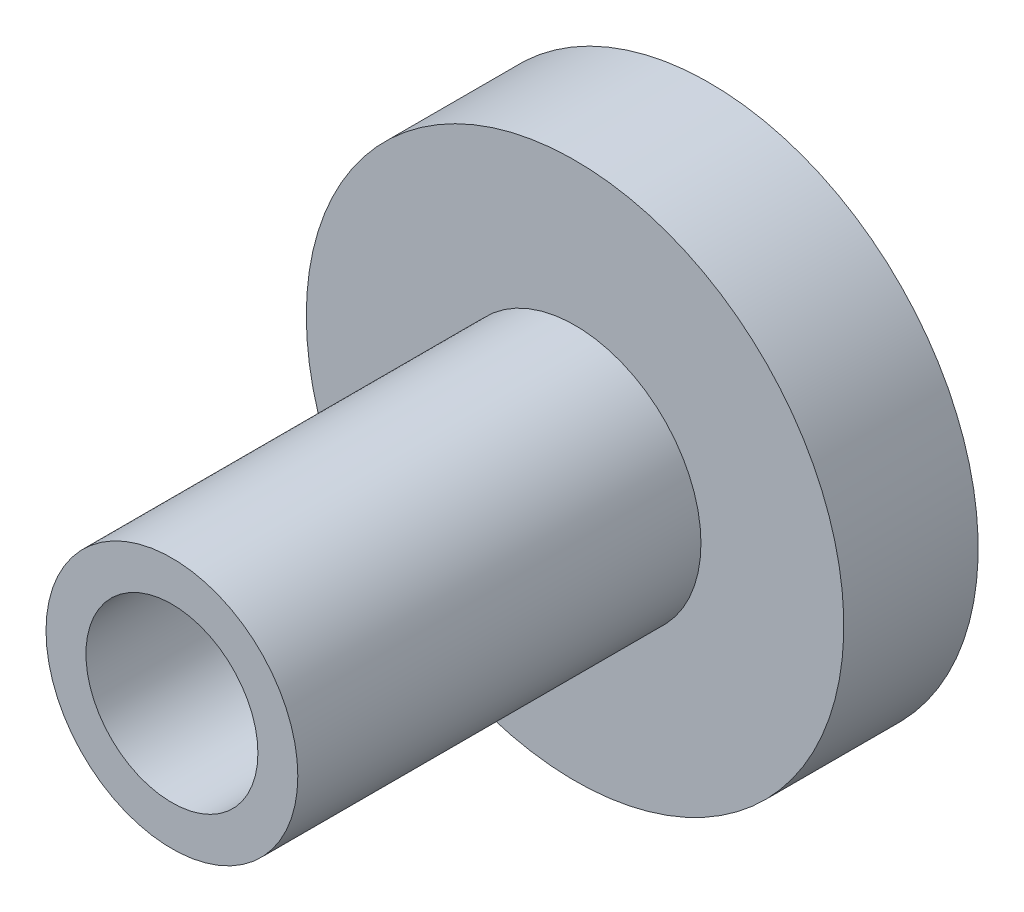
ISO-10303-21;
HEADER;
FILE_DESCRIPTION(('STEP AP214'),'2;1');
FILE_NAME('part.step','',(''),(''),'','','');
FILE_SCHEMA(('AUTOMOTIVE_DESIGN { 1 0 10303 214 1 1 1 1 }'));
ENDSEC;
DATA;
#1=APPLICATION_CONTEXT('core data for automotive mechanical design processes');
#2=APPLICATION_PROTOCOL_DEFINITION('international standard','automotive_design',2000,#1);
#3=PRODUCT_CONTEXT('',#1,'mechanical');
#4=PRODUCT('Part','Part','',(#3));
#5=PRODUCT_RELATED_PRODUCT_CATEGORY('part','',(#4));
#6=PRODUCT_DEFINITION_FORMATION('','',#4);
#7=PRODUCT_DEFINITION_CONTEXT('part definition',#1,'design');
#8=PRODUCT_DEFINITION('design','',#6,#7);
#9=PRODUCT_DEFINITION_SHAPE('','',#8);
#10=(LENGTH_UNIT() NAMED_UNIT(*) SI_UNIT(.MILLI.,.METRE.));
#11=(NAMED_UNIT(*) PLANE_ANGLE_UNIT() SI_UNIT($,.RADIAN.));
#12=(NAMED_UNIT(*) SI_UNIT($,.STERADIAN.) SOLID_ANGLE_UNIT());
#13=UNCERTAINTY_MEASURE_WITH_UNIT(LENGTH_MEASURE(1.E-05),#10,'distance_accuracy_value','');
#14=(GEOMETRIC_REPRESENTATION_CONTEXT(3) GLOBAL_UNCERTAINTY_ASSIGNED_CONTEXT((#13)) GLOBAL_UNIT_ASSIGNED_CONTEXT((#10,
#11,#12)) REPRESENTATION_CONTEXT('',''));
#15=CARTESIAN_POINT('',(0.,0.,0.));
#16=DIRECTION('',(0.,0.,1.));
#17=DIRECTION('',(1.,0.,0.));
#18=AXIS2_PLACEMENT_3D('',#15,#16,#17);
#19=CARTESIAN_POINT('',(0.,0.,19.05));
#20=DIRECTION('',(0.,0.,-1.));
#21=DIRECTION('',(-1.,0.,0.));
#22=AXIS2_PLACEMENT_3D('',#19,#20,#21);
#23=CYLINDRICAL_SURFACE('',#22,5.95);
#24=CARTESIAN_POINT('',(0.,0.,0.));
#25=DIRECTION('',(0.,0.,1.));
#26=DIRECTION('',(1.,0.,0.));
#27=AXIS2_PLACEMENT_3D('',#24,#25,#26);
#28=CIRCLE('',#27,5.95);
#29=CARTESIAN_POINT('',(5.95,0.,0.));
#30=VERTEX_POINT('',#29);
#31=EDGE_CURVE('E128',#30,#30,#28,.T.);
#32=ORIENTED_EDGE('',*,*,#31,.T.);
#33=EDGE_LOOP('',(#32));
#34=FACE_BOUND('',#33,.T.);
#35=CARTESIAN_POINT('',(0.,0.,19.05));
#36=DIRECTION('',(0.,0.,1.));
#37=DIRECTION('',(1.,0.,0.));
#38=AXIS2_PLACEMENT_3D('',#35,#36,#37);
#39=CIRCLE('',#38,5.95);
#40=CARTESIAN_POINT('',(5.95,0.,19.05));
#41=VERTEX_POINT('',#40);
#42=EDGE_CURVE('E123',#41,#41,#39,.T.);
#43=ORIENTED_EDGE('',*,*,#42,.F.);
#44=EDGE_LOOP('',(#43));
#45=FACE_BOUND('',#44,.T.);
#46=CARTESIAN_POINT('',(0.,0.,17.0191977694669));
#47=DIRECTION('',(-0.906307787036651,0.,0.422618261740698));
#48=DIRECTION('',(-0.422618261740698,0.,-0.906307787036651));
#49=AXIS2_PLACEMENT_3D('',#46,#47,#48);
#50=ELLIPSE('',#49,14.0788994197574,5.95);
#51=CARTESIAN_POINT('',(-5.13833630662688,3.,6.));
#52=VERTEX_POINT('',#51);
#53=CARTESIAN_POINT('',(-5.13833630662688,-3.,6.));
#54=VERTEX_POINT('',#53);
#55=EDGE_CURVE('E14',#52,#54,#50,.T.);
#56=ORIENTED_EDGE('',*,*,#55,.F.);
#57=DIRECTION('',(0.,0.,-1.));
#58=VECTOR('',#57,1.);
#59=CARTESIAN_POINT('',(-5.13833630662688,3.,12.));
#60=LINE('',#59,#58);
#61=CARTESIAN_POINT('',(-5.13833630662688,3.,12.));
#62=VERTEX_POINT('',#61);
#63=EDGE_CURVE('E163',#62,#52,#60,.T.);
#64=ORIENTED_EDGE('',*,*,#63,.F.);
#65=CARTESIAN_POINT('',(0.,0.,0.980802230533071));
#66=DIRECTION('',(-0.906307787036651,0.,-0.422618261740698));
#67=DIRECTION('',(0.422618261740698,0.,-0.906307787036651));
#68=AXIS2_PLACEMENT_3D('',#65,#66,#67);
#69=ELLIPSE('',#68,14.0788994197574,5.95);
#70=CARTESIAN_POINT('',(-5.13833630662688,-3.,12.));
#71=VERTEX_POINT('',#70);
#72=EDGE_CURVE('E44',#71,#62,#69,.T.);
#73=ORIENTED_EDGE('',*,*,#72,.F.);
#74=DIRECTION('',(0.,0.,1.));
#75=VECTOR('',#74,1.);
#76=CARTESIAN_POINT('',(-5.13833630662688,-3.,12.));
#77=LINE('',#76,#75);
#78=EDGE_CURVE('E192',#54,#71,#77,.T.);
#79=ORIENTED_EDGE('',*,*,#78,.F.);
#80=EDGE_LOOP('',(#56,#64,#73,#79));
#81=FACE_BOUND('',#80,.T.);
#82=ADVANCED_FACE('F36',(#34,#45,#81),#23,.T.);
#83=CARTESIAN_POINT('',(0.,0.,3.175));
#84=DIRECTION('',(0.,0.,1.));
#85=DIRECTION('',(1.,0.,0.));
#86=AXIS2_PLACEMENT_3D('',#83,#84,#85);
#87=CYLINDRICAL_SURFACE('',#86,2.2479);
#88=CARTESIAN_POINT('',(0.,0.,1.52323237602752));
#89=DIRECTION('',(0.,0.,1.));
#90=DIRECTION('',(1.,0.,0.));
#91=AXIS2_PLACEMENT_3D('',#88,#89,#90);
#92=CIRCLE('',#91,2.2479);
#93=CARTESIAN_POINT('',(2.2479,0.,1.52323237602752));
#94=VERTEX_POINT('',#93);
#95=EDGE_CURVE('E200',#94,#94,#92,.T.);
#96=ORIENTED_EDGE('',*,*,#95,.T.);
#97=EDGE_LOOP('',(#96));
#98=FACE_BOUND('',#97,.T.);
#99=CARTESIAN_POINT('',(0.,0.,-1.5875));
#100=DIRECTION('',(0.,0.,-1.));
#101=DIRECTION('',(-1.,0.,0.));
#102=AXIS2_PLACEMENT_3D('',#99,#100,#101);
#103=CIRCLE('',#102,2.2479);
#104=CARTESIAN_POINT('',(-2.2479,0.,-1.5875));
#105=VERTEX_POINT('',#104);
#106=EDGE_CURVE('E139',#105,#105,#103,.F.);
#107=ORIENTED_EDGE('',*,*,#106,.F.);
#108=EDGE_LOOP('',(#107));
#109=FACE_BOUND('',#108,.T.);
#110=ADVANCED_FACE('F231',(#98,#109),#87,.F.);
#111=CARTESIAN_POINT('',(0.,0.,19.05));
#112=DIRECTION('',(0.,0.,1.));
#113=DIRECTION('',(1.,0.,0.));
#114=AXIS2_PLACEMENT_3D('',#111,#112,#113);
#115=PLANE('',#114);
#116=CARTESIAN_POINT('',(0.,0.,19.05));
#117=DIRECTION('',(0.,0.,1.));
#118=DIRECTION('',(1.,0.,0.));
#119=AXIS2_PLACEMENT_3D('',#116,#117,#118);
#120=CIRCLE('',#119,4.064);
#121=CARTESIAN_POINT('',(4.064,0.,19.05));
#122=VERTEX_POINT('',#121);
#123=EDGE_CURVE('E203',#122,#122,#120,.T.);
#124=ORIENTED_EDGE('',*,*,#123,.F.);
#125=EDGE_LOOP('',(#124));
#126=FACE_BOUND('',#125,.T.);
#127=ORIENTED_EDGE('',*,*,#42,.T.);
#128=EDGE_LOOP('',(#127));
#129=FACE_BOUND('',#128,.T.);
#130=ADVANCED_FACE('F237',(#126,#129),#115,.T.);
#131=CARTESIAN_POINT('',(0.,0.,-6.35));
#132=DIRECTION('',(0.,0.,1.));
#133=DIRECTION('',(1.,0.,0.));
#134=AXIS2_PLACEMENT_3D('',#131,#132,#133);
#135=CYLINDRICAL_SURFACE('',#134,12.7);
#136=CARTESIAN_POINT('',(0.,0.,-6.35));
#137=DIRECTION('',(0.,0.,-1.));
#138=DIRECTION('',(-1.,0.,0.));
#139=AXIS2_PLACEMENT_3D('',#136,#137,#138);
#140=CIRCLE('',#139,12.7);
#141=CARTESIAN_POINT('',(-12.7,0.,-6.35));
#142=VERTEX_POINT('',#141);
#143=EDGE_CURVE('E133',#142,#142,#140,.T.);
#144=ORIENTED_EDGE('',*,*,#143,.F.);
#145=EDGE_LOOP('',(#144));
#146=FACE_BOUND('',#145,.T.);
#147=CARTESIAN_POINT('',(0.,0.,0.));
#148=DIRECTION('',(0.,0.,-1.));
#149=DIRECTION('',(-1.,0.,0.));
#150=AXIS2_PLACEMENT_3D('',#147,#148,#149);
#151=CIRCLE('',#150,12.7);
#152=CARTESIAN_POINT('',(-12.7,0.,0.));
#153=VERTEX_POINT('',#152);
#154=EDGE_CURVE('E136',#153,#153,#151,.T.);
#155=ORIENTED_EDGE('',*,*,#154,.T.);
#156=EDGE_LOOP('',(#155));
#157=FACE_BOUND('',#156,.T.);
#158=ADVANCED_FACE('F211',(#146,#157),#135,.T.);
#159=CARTESIAN_POINT('',(0.,0.,-6.35));
#160=DIRECTION('',(0.,0.,-1.));
#161=DIRECTION('',(-1.,0.,0.));
#162=AXIS2_PLACEMENT_3D('',#159,#160,#161);
#163=PLANE('',#162);
#164=DIRECTION('',(-1.,0.,0.));
#165=VECTOR('',#164,1.);
#166=CARTESIAN_POINT('',(0.,-4.6355,-6.35));
#167=LINE('',#166,#165);
#168=CARTESIAN_POINT('',(2.67630717282851,-4.6355,-6.35));
#169=VERTEX_POINT('',#168);
#170=CARTESIAN_POINT('',(-2.67630717282851,-4.6355,-6.35));
#171=VERTEX_POINT('',#170);
#172=EDGE_CURVE('E60',#169,#171,#167,.T.);
#173=ORIENTED_EDGE('',*,*,#172,.F.);
#174=DIRECTION('',(-0.5,-0.866025403784438,0.));
#175=VECTOR('',#174,1.);
#176=CARTESIAN_POINT('',(4.01446075924276,-2.31775,-6.35));
#177=LINE('',#176,#175);
#178=CARTESIAN_POINT('',(5.35261434565702,0.,-6.35));
#179=VERTEX_POINT('',#178);
#180=EDGE_CURVE('E154',#179,#169,#177,.T.);
#181=ORIENTED_EDGE('',*,*,#180,.F.);
#182=DIRECTION('',(0.5,-0.866025403784439,0.));
#183=VECTOR('',#182,1.);
#184=CARTESIAN_POINT('',(4.01446075924277,2.31775,-6.35));
#185=LINE('',#184,#183);
#186=CARTESIAN_POINT('',(2.67630717282851,4.6355,-6.35));
#187=VERTEX_POINT('',#186);
#188=EDGE_CURVE('E152',#187,#179,#185,.T.);
#189=ORIENTED_EDGE('',*,*,#188,.F.);
#190=DIRECTION('',(1.,0.,0.));
#191=VECTOR('',#190,1.);
#192=CARTESIAN_POINT('',(0.,4.6355,-6.35));
#193=LINE('',#192,#191);
#194=CARTESIAN_POINT('',(-2.67630717282851,4.6355,-6.35));
#195=VERTEX_POINT('',#194);
#196=EDGE_CURVE('E98',#195,#187,#193,.T.);
#197=ORIENTED_EDGE('',*,*,#196,.F.);
#198=DIRECTION('',(0.5,0.866025403784438,0.));
#199=VECTOR('',#198,1.);
#200=CARTESIAN_POINT('',(-4.01446075924276,2.31775,-6.35));
#201=LINE('',#200,#199);
#202=CARTESIAN_POINT('',(-5.35261434565702,0.,-6.35));
#203=VERTEX_POINT('',#202);
#204=EDGE_CURVE('E156',#203,#195,#201,.T.);
#205=ORIENTED_EDGE('',*,*,#204,.F.);
#206=DIRECTION('',(-0.5,0.866025403784439,0.));
#207=VECTOR('',#206,1.);
#208=CARTESIAN_POINT('',(-4.01446075924276,-2.31775,-6.35));
#209=LINE('',#208,#207);
#210=EDGE_CURVE('E159',#171,#203,#209,.T.);
#211=ORIENTED_EDGE('',*,*,#210,.F.);
#212=EDGE_LOOP('',(#173,#181,#189,#197,#205,#211));
#213=FACE_BOUND('',#212,.T.);
#214=ORIENTED_EDGE('',*,*,#143,.T.);
#215=EDGE_LOOP('',(#214));
#216=FACE_BOUND('',#215,.T.);
#217=ADVANCED_FACE('F216',(#213,#216),#163,.T.);
#218=CARTESIAN_POINT('',(0.,0.,0.));
#219=DIRECTION('',(0.,0.,-1.));
#220=DIRECTION('',(-1.,0.,0.));
#221=AXIS2_PLACEMENT_3D('',#218,#219,#220);
#222=PLANE('',#221);
#223=ORIENTED_EDGE('',*,*,#31,.F.);
#224=EDGE_LOOP('',(#223));
#225=FACE_BOUND('',#224,.T.);
#226=ORIENTED_EDGE('',*,*,#154,.F.);
#227=EDGE_LOOP('',(#226));
#228=FACE_BOUND('',#227,.T.);
#229=ADVANCED_FACE('F213',(#225,#228),#222,.F.);
#230=CARTESIAN_POINT('',(0.,0.,-11.4947278349685));
#231=DIRECTION('',(0.,0.,1.));
#232=DIRECTION('',(1.,0.,0.));
#233=AXIS2_PLACEMENT_3D('',#230,#231,#232);
#234=CYLINDRICAL_SURFACE('',#233,4.064);
#235=ORIENTED_EDGE('',*,*,#123,.T.);
#236=EDGE_LOOP('',(#235));
#237=FACE_BOUND('',#236,.T.);
#238=CARTESIAN_POINT('',(0.,0.,3.04712121620858));
#239=DIRECTION('',(0.,0.,1.));
#240=DIRECTION('',(1.,0.,0.));
#241=AXIS2_PLACEMENT_3D('',#238,#239,#240);
#242=CIRCLE('',#241,4.064);
#243=CARTESIAN_POINT('',(4.064,0.,3.04712121620858));
#244=VERTEX_POINT('',#243);
#245=EDGE_CURVE('E142',#244,#244,#242,.F.);
#246=ORIENTED_EDGE('',*,*,#245,.T.);
#247=EDGE_LOOP('',(#246));
#248=FACE_BOUND('',#247,.T.);
#249=ADVANCED_FACE('F215',(#237,#248),#234,.F.);
#250=CARTESIAN_POINT('',(0.,0.,3.175));
#251=DIRECTION('',(0.,0.,1.));
#252=DIRECTION('',(1.,0.,0.));
#253=AXIS2_PLACEMENT_3D('',#250,#251,#252);
#254=CONICAL_SURFACE('',#253,4.2164,0.872664625997165);
#255=ORIENTED_EDGE('',*,*,#245,.F.);
#256=EDGE_LOOP('',(#255));
#257=FACE_BOUND('',#256,.T.);
#258=ORIENTED_EDGE('',*,*,#95,.F.);
#259=EDGE_LOOP('',(#258));
#260=FACE_BOUND('',#259,.T.);
#261=ADVANCED_FACE('F223',(#257,#260),#254,.F.);
#262=CARTESIAN_POINT('',(0.,0.,-1.5875));
#263=DIRECTION('',(0.,0.,-1.));
#264=DIRECTION('',(-1.,0.,0.));
#265=AXIS2_PLACEMENT_3D('',#262,#263,#264);
#266=PLANE('',#265);
#267=DIRECTION('',(-1.,0.,0.));
#268=VECTOR('',#267,1.);
#269=CARTESIAN_POINT('',(0.,-4.6355,-1.5875));
#270=LINE('',#269,#268);
#271=CARTESIAN_POINT('',(2.67630717282851,-4.6355,-1.5875));
#272=VERTEX_POINT('',#271);
#273=CARTESIAN_POINT('',(-2.67630717282851,-4.6355,-1.5875));
#274=VERTEX_POINT('',#273);
#275=EDGE_CURVE('E165',#272,#274,#270,.T.);
#276=ORIENTED_EDGE('',*,*,#275,.T.);
#277=DIRECTION('',(-0.5,0.866025403784439,0.));
#278=VECTOR('',#277,1.);
#279=CARTESIAN_POINT('',(-4.01446075924276,-2.31775,-1.5875));
#280=LINE('',#279,#278);
#281=CARTESIAN_POINT('',(-5.35261434565702,0.,-1.5875));
#282=VERTEX_POINT('',#281);
#283=EDGE_CURVE('E120',#274,#282,#280,.T.);
#284=ORIENTED_EDGE('',*,*,#283,.T.);
#285=DIRECTION('',(0.5,0.866025403784438,0.));
#286=VECTOR('',#285,1.);
#287=CARTESIAN_POINT('',(-4.01446075924276,2.31775,-1.5875));
#288=LINE('',#287,#286);
#289=CARTESIAN_POINT('',(-2.67630717282851,4.6355,-1.5875));
#290=VERTEX_POINT('',#289);
#291=EDGE_CURVE('E118',#282,#290,#288,.T.);
#292=ORIENTED_EDGE('',*,*,#291,.T.);
#293=DIRECTION('',(1.,0.,0.));
#294=VECTOR('',#293,1.);
#295=CARTESIAN_POINT('',(0.,4.6355,-1.5875));
#296=LINE('',#295,#294);
#297=CARTESIAN_POINT('',(2.67630717282851,4.6355,-1.5875));
#298=VERTEX_POINT('',#297);
#299=EDGE_CURVE('E95',#290,#298,#296,.T.);
#300=ORIENTED_EDGE('',*,*,#299,.T.);
#301=DIRECTION('',(0.5,-0.866025403784439,0.));
#302=VECTOR('',#301,1.);
#303=CARTESIAN_POINT('',(4.01446075924277,2.31775,-1.5875));
#304=LINE('',#303,#302);
#305=CARTESIAN_POINT('',(5.35261434565702,0.,-1.5875));
#306=VERTEX_POINT('',#305);
#307=EDGE_CURVE('E106',#298,#306,#304,.T.);
#308=ORIENTED_EDGE('',*,*,#307,.T.);
#309=DIRECTION('',(-0.5,-0.866025403784438,0.));
#310=VECTOR('',#309,1.);
#311=CARTESIAN_POINT('',(4.01446075924276,-2.31775,-1.5875));
#312=LINE('',#311,#310);
#313=EDGE_CURVE('E111',#306,#272,#312,.T.);
#314=ORIENTED_EDGE('',*,*,#313,.T.);
#315=EDGE_LOOP('',(#276,#284,#292,#300,#308,#314));
#316=FACE_BOUND('',#315,.T.);
#317=ORIENTED_EDGE('',*,*,#106,.T.);
#318=EDGE_LOOP('',(#317));
#319=FACE_BOUND('',#318,.T.);
#320=ADVANCED_FACE('F114',(#316,#319),#266,.T.);
#321=CARTESIAN_POINT('',(2.52966020445435,-4.6355,-1.5875));
#322=DIRECTION('',(0.,-1.,0.));
#323=DIRECTION('',(0.,0.,-1.));
#324=AXIS2_PLACEMENT_3D('',#321,#322,#323);
#325=PLANE('',#324);
#326=ORIENTED_EDGE('',*,*,#172,.T.);
#327=DIRECTION('',(0.,0.,-1.));
#328=VECTOR('',#327,1.);
#329=CARTESIAN_POINT('',(-2.67630717282851,-4.6355,-1.5875));
#330=LINE('',#329,#328);
#331=EDGE_CURVE('E149',#274,#171,#330,.T.);
#332=ORIENTED_EDGE('',*,*,#331,.F.);
#333=ORIENTED_EDGE('',*,*,#275,.F.);
#334=DIRECTION('',(0.,0.,-1.));
#335=VECTOR('',#334,1.);
#336=CARTESIAN_POINT('',(2.67630717282851,-4.6355,-1.5875));
#337=LINE('',#336,#335);
#338=EDGE_CURVE('E143',#272,#169,#337,.T.);
#339=ORIENTED_EDGE('',*,*,#338,.T.);
#340=EDGE_LOOP('',(#326,#332,#333,#339));
#341=FACE_BOUND('',#340,.T.);
#342=ADVANCED_FACE('F252',(#341),#325,.F.);
#343=CARTESIAN_POINT('',(5.27929086146994,-0.127000000000001,-1.5875));
#344=DIRECTION('',(0.866025403784438,-0.5,0.));
#345=DIRECTION('',(0.5,0.866025403784438,0.));
#346=AXIS2_PLACEMENT_3D('',#343,#344,#345);
#347=PLANE('',#346);
#348=ORIENTED_EDGE('',*,*,#180,.T.);
#349=ORIENTED_EDGE('',*,*,#338,.F.);
#350=ORIENTED_EDGE('',*,*,#313,.F.);
#351=DIRECTION('',(0.,0.,-1.));
#352=VECTOR('',#351,1.);
#353=CARTESIAN_POINT('',(5.35261434565702,0.,-1.5875));
#354=LINE('',#353,#352);
#355=EDGE_CURVE('E102',#306,#179,#354,.T.);
#356=ORIENTED_EDGE('',*,*,#355,.T.);
#357=EDGE_LOOP('',(#348,#349,#350,#356));
#358=FACE_BOUND('',#357,.T.);
#359=ADVANCED_FACE('F245',(#358),#347,.F.);
#360=CARTESIAN_POINT('',(2.74963065701559,4.5085,-1.5875));
#361=DIRECTION('',(0.866025403784439,0.5,0.));
#362=DIRECTION('',(-0.5,0.866025403784439,0.));
#363=AXIS2_PLACEMENT_3D('',#360,#361,#362);
#364=PLANE('',#363);
#365=ORIENTED_EDGE('',*,*,#188,.T.);
#366=ORIENTED_EDGE('',*,*,#355,.F.);
#367=ORIENTED_EDGE('',*,*,#307,.F.);
#368=DIRECTION('',(0.,0.,-1.));
#369=VECTOR('',#368,1.);
#370=CARTESIAN_POINT('',(2.67630717282851,4.6355,-1.5875));
#371=LINE('',#370,#369);
#372=EDGE_CURVE('E90',#298,#187,#371,.T.);
#373=ORIENTED_EDGE('',*,*,#372,.T.);
#374=EDGE_LOOP('',(#365,#366,#367,#373));
#375=FACE_BOUND('',#374,.T.);
#376=ADVANCED_FACE('F107',(#375),#364,.F.);
#377=CARTESIAN_POINT('',(-2.52966020445434,4.6355,-1.5875));
#378=DIRECTION('',(0.,1.,0.));
#379=DIRECTION('',(0.,0.,1.));
#380=AXIS2_PLACEMENT_3D('',#377,#378,#379);
#381=PLANE('',#380);
#382=ORIENTED_EDGE('',*,*,#196,.T.);
#383=ORIENTED_EDGE('',*,*,#372,.F.);
#384=ORIENTED_EDGE('',*,*,#299,.F.);
#385=DIRECTION('',(0.,0.,-1.));
#386=VECTOR('',#385,1.);
#387=CARTESIAN_POINT('',(-2.67630717282851,4.6355,-1.5875));
#388=LINE('',#387,#386);
#389=EDGE_CURVE('E103',#290,#195,#388,.T.);
#390=ORIENTED_EDGE('',*,*,#389,.T.);
#391=EDGE_LOOP('',(#382,#383,#384,#390));
#392=FACE_BOUND('',#391,.T.);
#393=ADVANCED_FACE('F92',(#392),#381,.F.);
#394=CARTESIAN_POINT('',(-5.27929086146994,0.127000000000002,-1.5875));
#395=DIRECTION('',(-0.866025403784438,0.5,0.));
#396=DIRECTION('',(-0.5,-0.866025403784438,0.));
#397=AXIS2_PLACEMENT_3D('',#394,#395,#396);
#398=PLANE('',#397);
#399=ORIENTED_EDGE('',*,*,#204,.T.);
#400=ORIENTED_EDGE('',*,*,#389,.F.);
#401=ORIENTED_EDGE('',*,*,#291,.F.);
#402=DIRECTION('',(0.,0.,-1.));
#403=VECTOR('',#402,1.);
#404=CARTESIAN_POINT('',(-5.35261434565702,0.,-1.5875));
#405=LINE('',#404,#403);
#406=EDGE_CURVE('E146',#282,#203,#405,.T.);
#407=ORIENTED_EDGE('',*,*,#406,.T.);
#408=EDGE_LOOP('',(#399,#400,#401,#407));
#409=FACE_BOUND('',#408,.T.);
#410=ADVANCED_FACE('F175',(#409),#398,.F.);
#411=CARTESIAN_POINT('',(-2.74963065701559,-4.5085,-1.5875));
#412=DIRECTION('',(-0.866025403784439,-0.5,0.));
#413=DIRECTION('',(0.5,-0.866025403784439,0.));
#414=AXIS2_PLACEMENT_3D('',#411,#412,#413);
#415=PLANE('',#414);
#416=ORIENTED_EDGE('',*,*,#210,.T.);
#417=ORIENTED_EDGE('',*,*,#406,.F.);
#418=ORIENTED_EDGE('',*,*,#283,.F.);
#419=ORIENTED_EDGE('',*,*,#331,.T.);
#420=EDGE_LOOP('',(#416,#417,#418,#419));
#421=FACE_BOUND('',#420,.T.);
#422=ADVANCED_FACE('F171',(#421),#415,.F.);
#423=CARTESIAN_POINT('',(-5.13833630662688,3.,6.));
#424=DIRECTION('',(-0.906307787036651,0.,0.422618261740698));
#425=DIRECTION('',(0.422618261740698,0.,0.906307787036651));
#426=AXIS2_PLACEMENT_3D('',#423,#424,#425);
#427=PLANE('',#426);
#428=ORIENTED_EDGE('',*,*,#55,.T.);
#429=DIRECTION('',(0.,-1.,0.));
#430=VECTOR('',#429,1.);
#431=CARTESIAN_POINT('',(-5.13833630662688,3.,6.));
#432=LINE('',#431,#430);
#433=EDGE_CURVE('E188',#52,#54,#432,.T.);
#434=ORIENTED_EDGE('',*,*,#433,.F.);
#435=EDGE_LOOP('',(#428,#434));
#436=FACE_BOUND('',#435,.T.);
#437=ADVANCED_FACE('F38',(#436),#427,.T.);
#438=CARTESIAN_POINT('',(-5.13833630662688,3.,12.));
#439=DIRECTION('',(-0.906307787036651,0.,-0.422618261740698));
#440=DIRECTION('',(-0.422618261740698,0.,0.906307787036651));
#441=AXIS2_PLACEMENT_3D('',#438,#439,#440);
#442=PLANE('',#441);
#443=ORIENTED_EDGE('',*,*,#72,.T.);
#444=DIRECTION('',(0.,1.,0.));
#445=VECTOR('',#444,1.);
#446=CARTESIAN_POINT('',(-5.13833630662688,3.,12.));
#447=LINE('',#446,#445);
#448=EDGE_CURVE('E51',#71,#62,#447,.T.);
#449=ORIENTED_EDGE('',*,*,#448,.F.);
#450=EDGE_LOOP('',(#443,#449));
#451=FACE_BOUND('',#450,.T.);
#452=ADVANCED_FACE('F257',(#451),#442,.T.);
#453=CARTESIAN_POINT('',(-5.13833630662688,0.,0.));
#454=DIRECTION('',(1.,0.,0.));
#455=DIRECTION('',(0.,0.,-1.));
#456=AXIS2_PLACEMENT_3D('',#453,#454,#455);
#457=PLANE('',#456);
#458=ORIENTED_EDGE('',*,*,#433,.T.);
#459=ORIENTED_EDGE('',*,*,#78,.T.);
#460=ORIENTED_EDGE('',*,*,#448,.T.);
#461=ORIENTED_EDGE('',*,*,#63,.T.);
#462=EDGE_LOOP('',(#458,#459,#460,#461));
#463=FACE_BOUND('',#462,.T.);
#464=ADVANCED_FACE('F191',(#463),#457,.F.);
#465=CLOSED_SHELL('',(#82,#110,#130,#158,#217,#229,#249,#261,#320,#342,#359,#376,#393,#410,#422,
#437,#452,#464));
#466=MANIFOLD_SOLID_BREP('B2',#465);
#467=ADVANCED_BREP_SHAPE_REPRESENTATION('',(#18,#466),#14);
#468=SHAPE_DEFINITION_REPRESENTATION(#9,#467);
ENDSEC;
END-ISO-10303-21;
